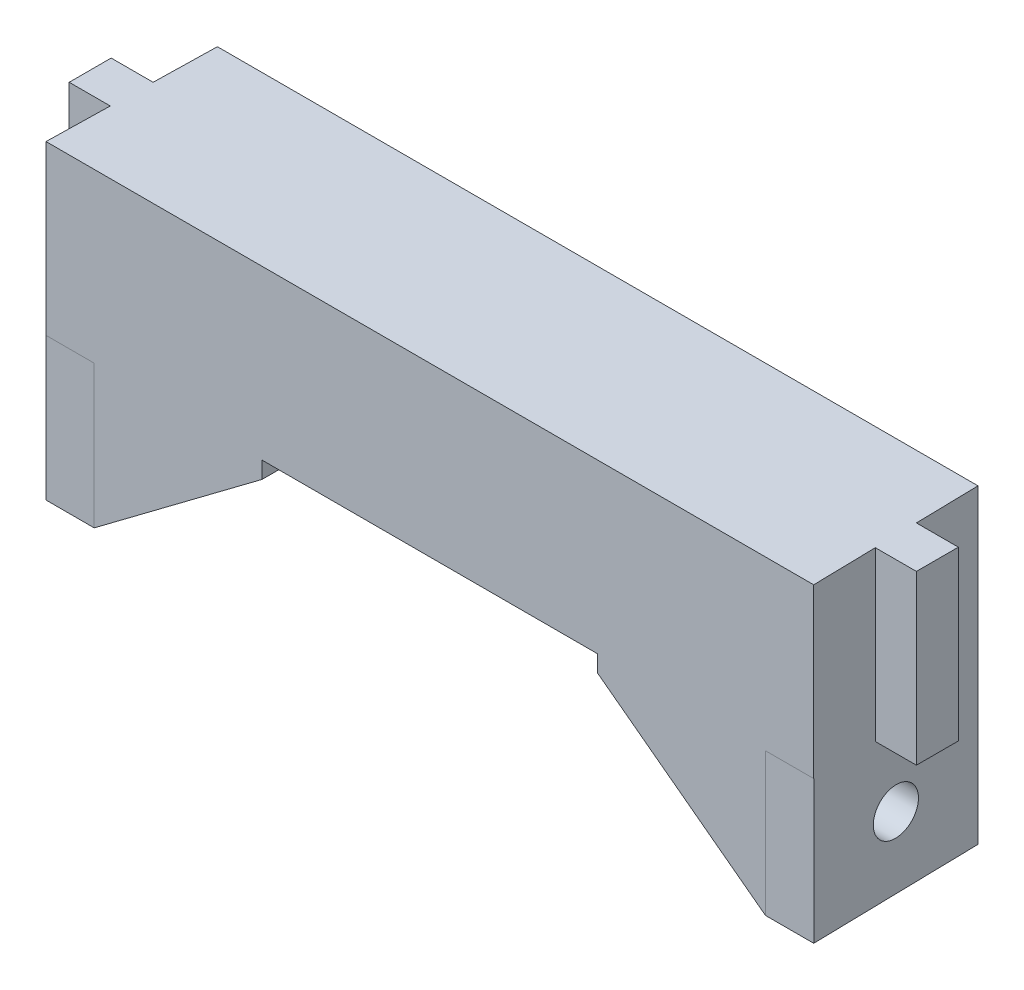
ISO-10303-21;
HEADER;
FILE_DESCRIPTION(('STEP AP214'),'2;1');
FILE_NAME('part.step','',(''),(''),'','','');
FILE_SCHEMA(('AUTOMOTIVE_DESIGN { 1 0 10303 214 1 1 1 1 }'));
ENDSEC;
DATA;
#1=APPLICATION_CONTEXT('core data for automotive mechanical design processes');
#2=APPLICATION_PROTOCOL_DEFINITION('international standard','automotive_design',2000,#1);
#3=PRODUCT_CONTEXT('',#1,'mechanical');
#4=PRODUCT('Part','Part','',(#3));
#5=PRODUCT_RELATED_PRODUCT_CATEGORY('part','',(#4));
#6=PRODUCT_DEFINITION_FORMATION('','',#4);
#7=PRODUCT_DEFINITION_CONTEXT('part definition',#1,'design');
#8=PRODUCT_DEFINITION('design','',#6,#7);
#9=PRODUCT_DEFINITION_SHAPE('','',#8);
#10=(LENGTH_UNIT() NAMED_UNIT(*) SI_UNIT(.MILLI.,.METRE.));
#11=(NAMED_UNIT(*) PLANE_ANGLE_UNIT() SI_UNIT($,.RADIAN.));
#12=(NAMED_UNIT(*) SI_UNIT($,.STERADIAN.) SOLID_ANGLE_UNIT());
#13=UNCERTAINTY_MEASURE_WITH_UNIT(LENGTH_MEASURE(1.E-05),#10,'distance_accuracy_value','');
#14=(GEOMETRIC_REPRESENTATION_CONTEXT(3) GLOBAL_UNCERTAINTY_ASSIGNED_CONTEXT((#13)) GLOBAL_UNIT_ASSIGNED_CONTEXT((#10,
#11,#12)) REPRESENTATION_CONTEXT('',''));
#15=CARTESIAN_POINT('',(0.,0.,0.));
#16=DIRECTION('',(0.,0.,1.));
#17=DIRECTION('',(1.,0.,0.));
#18=AXIS2_PLACEMENT_3D('',#15,#16,#17);
#19=CARTESIAN_POINT('',(0.,0.,0.));
#20=DIRECTION('',(0.,-1.,0.));
#21=DIRECTION('',(0.,0.,-1.));
#22=AXIS2_PLACEMENT_3D('',#19,#20,#21);
#23=PLANE('',#22);
#24=DIRECTION('',(-1.,0.,0.));
#25=VECTOR('',#24,1.);
#26=CARTESIAN_POINT('',(-45.3158214077717,0.,-20.));
#27=LINE('',#26,#25);
#28=CARTESIAN_POINT('',(20.,0.,-20.));
#29=VERTEX_POINT('',#28);
#30=CARTESIAN_POINT('',(-20.,0.,-20.));
#31=VERTEX_POINT('',#30);
#32=EDGE_CURVE('E441',#29,#31,#27,.T.);
#33=ORIENTED_EDGE('',*,*,#32,.F.);
#34=DIRECTION('',(0.,0.,-1.));
#35=VECTOR('',#34,1.);
#36=CARTESIAN_POINT('',(20.,0.,0.));
#37=LINE('',#36,#35);
#38=CARTESIAN_POINT('',(20.,0.,0.));
#39=VERTEX_POINT('',#38);
#40=EDGE_CURVE('E163',#29,#39,#37,.F.);
#41=ORIENTED_EDGE('',*,*,#40,.T.);
#42=DIRECTION('',(1.,0.,0.));
#43=VECTOR('',#42,1.);
#44=CARTESIAN_POINT('',(45.74,0.,0.));
#45=LINE('',#44,#43);
#46=CARTESIAN_POINT('',(-20.,0.,0.));
#47=VERTEX_POINT('',#46);
#48=EDGE_CURVE('E308',#47,#39,#45,.T.);
#49=ORIENTED_EDGE('',*,*,#48,.F.);
#50=DIRECTION('',(0.,0.,1.));
#51=VECTOR('',#50,1.);
#52=CARTESIAN_POINT('',(-20.,0.,-20.));
#53=LINE('',#52,#51);
#54=EDGE_CURVE('E575',#31,#47,#53,.T.);
#55=ORIENTED_EDGE('',*,*,#54,.F.);
#56=EDGE_LOOP('',(#33,#41,#49,#55));
#57=FACE_BOUND('',#56,.T.);
#58=ADVANCED_FACE('F139',(#57),#23,.T.);
#59=DIRECTION('',(0.0212041611335454,0.,0.99977516650026));
#60=VECTOR('',#59,1.);
#61=CARTESIAN_POINT('',(45.7194345436055,0.,-0.969660269109053));
#62=LINE('',#61,#60);
#63=CARTESIAN_POINT('',(45.4748883798573,0.,-12.5));
#64=VERTEX_POINT('',#63);
#65=CARTESIAN_POINT('',(45.5809330279144,0.,-7.49999999999999));
#66=VERTEX_POINT('',#65);
#67=EDGE_CURVE('E514',#64,#66,#62,.T.);
#68=ORIENTED_EDGE('',*,*,#67,.F.);
#69=DIRECTION('',(-1.,0.,0.));
#70=VECTOR('',#69,1.);
#71=CARTESIAN_POINT('',(45.4748883798573,0.,-12.5));
#72=LINE('',#71,#70);
#73=CARTESIAN_POINT('',(50.4748883798573,0.,-12.5));
#74=VERTEX_POINT('',#73);
#75=EDGE_CURVE('E483',#74,#64,#72,.T.);
#76=ORIENTED_EDGE('',*,*,#75,.F.);
#77=DIRECTION('',(0.,0.,-1.));
#78=VECTOR('',#77,1.);
#79=CARTESIAN_POINT('',(50.4748883798573,0.,-12.5));
#80=LINE('',#79,#78);
#81=CARTESIAN_POINT('',(50.4748883798573,0.,-7.49999999999999));
#82=VERTEX_POINT('',#81);
#83=EDGE_CURVE('E946',#82,#74,#80,.T.);
#84=ORIENTED_EDGE('',*,*,#83,.F.);
#85=DIRECTION('',(1.,0.,0.));
#86=VECTOR('',#85,1.);
#87=CARTESIAN_POINT('',(45.4748883798573,0.,-7.49999999999999));
#88=LINE('',#87,#86);
#89=EDGE_CURVE('E500',#66,#82,#88,.T.);
#90=ORIENTED_EDGE('',*,*,#89,.F.);
#91=EDGE_LOOP('',(#68,#76,#84,#90));
#92=FACE_BOUND('',#91,.T.);
#93=ADVANCED_FACE('F1083',(#92),#23,.T.);
#94=DIRECTION('',(0.999999628813922,0.,-0.000861610130870295));
#95=VECTOR('',#94,1.);
#96=CARTESIAN_POINT('',(40.,0.,0.));
#97=LINE('',#96,#95);
#98=CARTESIAN_POINT('',(40.,0.,0.));
#99=VERTEX_POINT('',#98);
#100=CARTESIAN_POINT('',(45.7398951101015,0.,-0.00494555361270745));
#101=VERTEX_POINT('',#100);
#102=EDGE_CURVE('E300',#99,#101,#97,.T.);
#103=ORIENTED_EDGE('',*,*,#102,.T.);
#104=DIRECTION('',(-0.0212041611335454,0.,-0.99977516650026));
#105=VECTOR('',#104,1.);
#106=CARTESIAN_POINT('',(45.3158214077717,0.,-20.));
#107=LINE('',#106,#105);
#108=CARTESIAN_POINT('',(45.74,0.,0.));
#109=VERTEX_POINT('',#108);
#110=EDGE_CURVE('E302',#109,#101,#107,.T.);
#111=ORIENTED_EDGE('',*,*,#110,.F.);
#112=EDGE_CURVE('E297',#99,#109,#45,.T.);
#113=ORIENTED_EDGE('',*,*,#112,.F.);
#114=EDGE_LOOP('',(#103,#111,#113));
#115=FACE_BOUND('',#114,.T.);
#116=ADVANCED_FACE('F299',(#115),#23,.T.);
#117=DIRECTION('',(-1.,0.,0.));
#118=VECTOR('',#117,1.);
#119=CARTESIAN_POINT('',(-45.4748883798573,0.,-12.5));
#120=LINE('',#119,#118);
#121=CARTESIAN_POINT('',(-45.4748883798573,0.,-12.5));
#122=VERTEX_POINT('',#121);
#123=CARTESIAN_POINT('',(-50.4748883798573,0.,-12.5));
#124=VERTEX_POINT('',#123);
#125=EDGE_CURVE('E466',#122,#124,#120,.T.);
#126=ORIENTED_EDGE('',*,*,#125,.F.);
#127=DIRECTION('',(-0.0212041611335457,0.,0.99977516650026));
#128=VECTOR('',#127,1.);
#129=CARTESIAN_POINT('',(-45.4748883798573,0.,-12.5));
#130=LINE('',#129,#128);
#131=CARTESIAN_POINT('',(-45.5809330279144,0.,-7.49999999999998));
#132=VERTEX_POINT('',#131);
#133=EDGE_CURVE('E14',#122,#132,#130,.T.);
#134=ORIENTED_EDGE('',*,*,#133,.T.);
#135=DIRECTION('',(1.,0.,0.));
#136=VECTOR('',#135,1.);
#137=CARTESIAN_POINT('',(-45.4748883798573,0.,-7.49999999999999));
#138=LINE('',#137,#136);
#139=CARTESIAN_POINT('',(-50.4748883798573,0.,-7.49999999999999));
#140=VERTEX_POINT('',#139);
#141=EDGE_CURVE('E873',#140,#132,#138,.T.);
#142=ORIENTED_EDGE('',*,*,#141,.F.);
#143=DIRECTION('',(0.,0.,1.));
#144=VECTOR('',#143,1.);
#145=CARTESIAN_POINT('',(-50.4748883798573,0.,-12.5));
#146=LINE('',#145,#144);
#147=EDGE_CURVE('E884',#124,#140,#146,.T.);
#148=ORIENTED_EDGE('',*,*,#147,.F.);
#149=EDGE_LOOP('',(#126,#134,#142,#148));
#150=FACE_BOUND('',#149,.T.);
#151=ADVANCED_FACE('F1079',(#150),#23,.T.);
#152=CARTESIAN_POINT('',(45.74,20.,0.));
#153=DIRECTION('',(0.,0.,-1.));
#154=DIRECTION('',(-1.,0.,0.));
#155=AXIS2_PLACEMENT_3D('',#152,#153,#154);
#156=PLANE('',#155);
#157=CARTESIAN_POINT('',(-45.74,0.,0.));
#158=VERTEX_POINT('',#157);
#159=CARTESIAN_POINT('',(-40.,0.,0.));
#160=VERTEX_POINT('',#159);
#161=EDGE_CURVE('E463',#158,#160,#45,.T.);
#162=ORIENTED_EDGE('',*,*,#161,.T.);
#163=DIRECTION('',(0.,1.,0.));
#164=VECTOR('',#163,1.);
#165=CARTESIAN_POINT('',(-40.,-17.,0.));
#166=LINE('',#165,#164);
#167=CARTESIAN_POINT('',(-40.,-17.,0.));
#168=VERTEX_POINT('',#167);
#169=EDGE_CURVE('E574',#168,#160,#166,.T.);
#170=ORIENTED_EDGE('',*,*,#169,.F.);
#171=DIRECTION('',(0.8,0.6,0.));
#172=VECTOR('',#171,1.);
#173=CARTESIAN_POINT('',(-40.,-17.,0.));
#174=LINE('',#173,#172);
#175=CARTESIAN_POINT('',(-20.,-2.,0.));
#176=VERTEX_POINT('',#175);
#177=EDGE_CURVE('E587',#168,#176,#174,.T.);
#178=ORIENTED_EDGE('',*,*,#177,.T.);
#179=DIRECTION('',(0.,-1.,0.));
#180=VECTOR('',#179,1.);
#181=CARTESIAN_POINT('',(-20.,0.,0.));
#182=LINE('',#181,#180);
#183=EDGE_CURVE('E561',#47,#176,#182,.T.);
#184=ORIENTED_EDGE('',*,*,#183,.F.);
#185=ORIENTED_EDGE('',*,*,#48,.T.);
#186=CARTESIAN_POINT('',(20.,0.,0.));
#187=DIRECTION('',(0.,-1.,0.));
#188=VECTOR('',#187,1.);
#189=LINE('',#186,#188);
#190=CARTESIAN_POINT('',(20.,-2.,0.));
#191=VERTEX_POINT('',#190);
#192=EDGE_CURVE('E348',#39,#191,#189,.T.);
#193=ORIENTED_EDGE('',*,*,#192,.T.);
#194=DIRECTION('',(-0.8,0.6,0.));
#195=VECTOR('',#194,1.);
#196=CARTESIAN_POINT('',(40.,-17.,0.));
#197=LINE('',#196,#195);
#198=CARTESIAN_POINT('',(40.,-17.,0.));
#199=VERTEX_POINT('',#198);
#200=EDGE_CURVE('E327',#199,#191,#197,.T.);
#201=ORIENTED_EDGE('',*,*,#200,.F.);
#202=CARTESIAN_POINT('',(40.,-17.,0.));
#203=DIRECTION('',(0.,1.,0.));
#204=VECTOR('',#203,1.);
#205=LINE('',#202,#204);
#206=EDGE_CURVE('E314',#199,#99,#205,.T.);
#207=ORIENTED_EDGE('',*,*,#206,.T.);
#208=ORIENTED_EDGE('',*,*,#112,.T.);
#209=DIRECTION('',(0.,-1.,0.));
#210=VECTOR('',#209,1.);
#211=CARTESIAN_POINT('',(45.74,20.,0.));
#212=LINE('',#211,#210);
#213=CARTESIAN_POINT('',(45.74,20.,0.));
#214=VERTEX_POINT('',#213);
#215=EDGE_CURVE('E150',#214,#109,#212,.T.);
#216=ORIENTED_EDGE('',*,*,#215,.F.);
#217=DIRECTION('',(1.,0.,0.));
#218=VECTOR('',#217,1.);
#219=CARTESIAN_POINT('',(45.74,20.,0.));
#220=LINE('',#219,#218);
#221=CARTESIAN_POINT('',(-45.74,20.,0.));
#222=VERTEX_POINT('',#221);
#223=EDGE_CURVE('E462',#222,#214,#220,.T.);
#224=ORIENTED_EDGE('',*,*,#223,.F.);
#225=DIRECTION('',(0.,-1.,0.));
#226=VECTOR('',#225,1.);
#227=CARTESIAN_POINT('',(-45.74,20.,0.));
#228=LINE('',#227,#226);
#229=EDGE_CURVE('E457',#222,#158,#228,.T.);
#230=ORIENTED_EDGE('',*,*,#229,.T.);
#231=EDGE_LOOP('',(#162,#170,#178,#184,#185,#193,#201,#207,#208,#216,#224,#230));
#232=FACE_BOUND('',#231,.T.);
#233=ADVANCED_FACE('F141',(#232),#156,.F.);
#234=CARTESIAN_POINT('',(45.3158214077717,20.,-20.));
#235=DIRECTION('',(-0.99977516650026,0.,0.0212041611335454));
#236=DIRECTION('',(0.0212041611335454,0.,0.99977516650026));
#237=AXIS2_PLACEMENT_3D('',#234,#235,#236);
#238=PLANE('',#237);
#239=CARTESIAN_POINT('',(45.5279107038858,-8.5,-10.));
#240=DIRECTION('',(-0.99977516650026,0.,0.0212041611335454));
#241=DIRECTION('',(-0.0212041611335454,0.,-0.99977516650026));
#242=AXIS2_PLACEMENT_3D('',#239,#240,#241);
#243=ELLIPSE('',#242,2.75061843116833,2.75);
#244=CARTESIAN_POINT('',(45.4695861474545,-8.5,-12.75));
#245=VERTEX_POINT('',#244);
#246=EDGE_CURVE('E353',#245,#245,#243,.F.);
#247=ORIENTED_EDGE('',*,*,#246,.F.);
#248=EDGE_LOOP('',(#247));
#249=FACE_BOUND('',#248,.T.);
#250=DIRECTION('',(-0.0212041611335454,0.,-0.99977516650026));
#251=VECTOR('',#250,1.);
#252=CARTESIAN_POINT('',(45.3158214077717,20.,-20.));
#253=LINE('',#252,#251);
#254=CARTESIAN_POINT('',(45.4748883798573,20.,-12.5));
#255=VERTEX_POINT('',#254);
#256=CARTESIAN_POINT('',(45.3158214077717,20.,-20.));
#257=VERTEX_POINT('',#256);
#258=EDGE_CURVE('E980',#255,#257,#253,.T.);
#259=ORIENTED_EDGE('',*,*,#258,.F.);
#260=DIRECTION('',(0.,1.,0.));
#261=VECTOR('',#260,1.);
#262=CARTESIAN_POINT('',(45.4748883798573,-7.07106781186547,-12.5));
#263=LINE('',#262,#261);
#264=EDGE_CURVE('E487',#64,#255,#263,.T.);
#265=ORIENTED_EDGE('',*,*,#264,.F.);
#266=ORIENTED_EDGE('',*,*,#67,.T.);
#267=DIRECTION('',(0.,1.,0.));
#268=VECTOR('',#267,1.);
#269=CARTESIAN_POINT('',(45.5809330279144,20.,-7.49999999999999));
#270=LINE('',#269,#268);
#271=CARTESIAN_POINT('',(45.5809330279144,20.,-7.49999999999999));
#272=VERTEX_POINT('',#271);
#273=EDGE_CURVE('E309',#66,#272,#270,.T.);
#274=ORIENTED_EDGE('',*,*,#273,.T.);
#275=EDGE_CURVE('E985',#214,#272,#253,.T.);
#276=ORIENTED_EDGE('',*,*,#275,.F.);
#277=ORIENTED_EDGE('',*,*,#215,.T.);
#278=ORIENTED_EDGE('',*,*,#110,.T.);
#279=CARTESIAN_POINT('',(45.7398951101015,0.,-0.00494555361270355));
#280=DIRECTION('',(0.,-1.,0.));
#281=VECTOR('',#280,1.);
#282=LINE('',#279,#281);
#283=CARTESIAN_POINT('',(45.7398951101015,-17.,-0.00494555361270355));
#284=VERTEX_POINT('',#283);
#285=EDGE_CURVE('E318',#101,#284,#282,.T.);
#286=ORIENTED_EDGE('',*,*,#285,.T.);
#287=CARTESIAN_POINT('',(45.3158214077717,-17.,-20.));
#288=DIRECTION('',(0.0212041611335454,0.,0.99977516650026));
#289=VECTOR('',#288,1.);
#290=LINE('',#287,#289);
#291=CARTESIAN_POINT('',(45.3158214077717,-17.,-20.));
#292=VERTEX_POINT('',#291);
#293=EDGE_CURVE('E719',#292,#284,#290,.T.);
#294=ORIENTED_EDGE('',*,*,#293,.F.);
#295=CARTESIAN_POINT('',(45.3158214077717,0.,-20.));
#296=DIRECTION('',(0.,-1.,0.));
#297=VECTOR('',#296,1.);
#298=LINE('',#295,#297);
#299=CARTESIAN_POINT('',(45.3158214077717,0.,-20.));
#300=VERTEX_POINT('',#299);
#301=EDGE_CURVE('E321',#300,#292,#298,.T.);
#302=ORIENTED_EDGE('',*,*,#301,.F.);
#303=DIRECTION('',(0.,-1.,0.));
#304=VECTOR('',#303,1.);
#305=CARTESIAN_POINT('',(45.3158214077717,20.,-20.));
#306=LINE('',#305,#304);
#307=EDGE_CURVE('E507',#257,#300,#306,.T.);
#308=ORIENTED_EDGE('',*,*,#307,.F.);
#309=EDGE_LOOP('',(#259,#265,#266,#274,#276,#277,#278,#286,#294,#302,#308));
#310=FACE_BOUND('',#309,.T.);
#311=ADVANCED_FACE('F536',(#249,#310),#238,.F.);
#312=CARTESIAN_POINT('',(-45.3158214077717,20.,-20.));
#313=DIRECTION('',(0.,0.,1.));
#314=DIRECTION('',(1.,0.,0.));
#315=AXIS2_PLACEMENT_3D('',#312,#313,#314);
#316=PLANE('',#315);
#317=CARTESIAN_POINT('',(20.,-2.,-20.));
#318=DIRECTION('',(0.,1.,0.));
#319=VECTOR('',#318,1.);
#320=LINE('',#317,#319);
#321=CARTESIAN_POINT('',(20.,-2.,-20.));
#322=VERTEX_POINT('',#321);
#323=EDGE_CURVE('E414',#322,#29,#320,.T.);
#324=ORIENTED_EDGE('',*,*,#323,.T.);
#325=ORIENTED_EDGE('',*,*,#32,.T.);
#326=DIRECTION('',(0.,1.,0.));
#327=VECTOR('',#326,1.);
#328=CARTESIAN_POINT('',(-20.,0.,-20.));
#329=LINE('',#328,#327);
#330=CARTESIAN_POINT('',(-20.,-2.,-20.));
#331=VERTEX_POINT('',#330);
#332=EDGE_CURVE('E655',#331,#31,#329,.T.);
#333=ORIENTED_EDGE('',*,*,#332,.F.);
#334=DIRECTION('',(0.8,0.6,0.));
#335=VECTOR('',#334,1.);
#336=CARTESIAN_POINT('',(-40.,-17.,-20.));
#337=LINE('',#336,#335);
#338=CARTESIAN_POINT('',(-40.,-17.,-20.));
#339=VERTEX_POINT('',#338);
#340=EDGE_CURVE('E651',#339,#331,#337,.T.);
#341=ORIENTED_EDGE('',*,*,#340,.F.);
#342=DIRECTION('',(-1.,0.,0.));
#343=VECTOR('',#342,1.);
#344=CARTESIAN_POINT('',(-40.,-17.,-20.));
#345=LINE('',#344,#343);
#346=CARTESIAN_POINT('',(-45.3158214077717,-17.,-20.));
#347=VERTEX_POINT('',#346);
#348=EDGE_CURVE('E580',#339,#347,#345,.T.);
#349=ORIENTED_EDGE('',*,*,#348,.T.);
#350=DIRECTION('',(0.,-1.,0.));
#351=VECTOR('',#350,1.);
#352=CARTESIAN_POINT('',(-45.3158214077717,0.,-20.));
#353=LINE('',#352,#351);
#354=CARTESIAN_POINT('',(-45.3158214077717,0.,-20.));
#355=VERTEX_POINT('',#354);
#356=EDGE_CURVE('E798',#355,#347,#353,.T.);
#357=ORIENTED_EDGE('',*,*,#356,.F.);
#358=DIRECTION('',(0.,-1.,0.));
#359=VECTOR('',#358,1.);
#360=CARTESIAN_POINT('',(-45.3158214077717,20.,-20.));
#361=LINE('',#360,#359);
#362=CARTESIAN_POINT('',(-45.3158214077717,20.,-20.));
#363=VERTEX_POINT('',#362);
#364=EDGE_CURVE('E511',#363,#355,#361,.T.);
#365=ORIENTED_EDGE('',*,*,#364,.F.);
#366=DIRECTION('',(-1.,0.,0.));
#367=VECTOR('',#366,1.);
#368=CARTESIAN_POINT('',(-45.3158214077717,20.,-20.));
#369=LINE('',#368,#367);
#370=EDGE_CURVE('E991',#257,#363,#369,.T.);
#371=ORIENTED_EDGE('',*,*,#370,.F.);
#372=ORIENTED_EDGE('',*,*,#307,.T.);
#373=ORIENTED_EDGE('',*,*,#301,.T.);
#374=DIRECTION('',(1.,0.,0.));
#375=VECTOR('',#374,1.);
#376=CARTESIAN_POINT('',(40.,-17.,-20.));
#377=LINE('',#376,#375);
#378=CARTESIAN_POINT('',(40.,-17.,-20.));
#379=VERTEX_POINT('',#378);
#380=EDGE_CURVE('E330',#379,#292,#377,.T.);
#381=ORIENTED_EDGE('',*,*,#380,.F.);
#382=DIRECTION('',(-0.8,0.6,0.));
#383=VECTOR('',#382,1.);
#384=CARTESIAN_POINT('',(40.,-17.,-20.));
#385=LINE('',#384,#383);
#386=EDGE_CURVE('E410',#379,#322,#385,.T.);
#387=ORIENTED_EDGE('',*,*,#386,.T.);
#388=EDGE_LOOP('',(#324,#325,#333,#341,#349,#357,#365,#371,#372,#373,#381,#387));
#389=FACE_BOUND('',#388,.T.);
#390=ADVANCED_FACE('F526',(#389),#316,.F.);
#391=CARTESIAN_POINT('',(-45.74,20.,0.));
#392=DIRECTION('',(0.99977516650026,0.,0.0212041611335453));
#393=DIRECTION('',(0.0212041611335453,0.,-0.99977516650026));
#394=AXIS2_PLACEMENT_3D('',#391,#392,#393);
#395=PLANE('',#394);
#396=CARTESIAN_POINT('',(-45.5279107038858,-8.5,-10.));
#397=DIRECTION('',(0.99977516650026,0.,0.0212041611335453));
#398=DIRECTION('',(0.0212041611335453,0.,-0.99977516650026));
#399=AXIS2_PLACEMENT_3D('',#396,#397,#398);
#400=ELLIPSE('',#399,2.75061843116833,2.75);
#401=CARTESIAN_POINT('',(-45.4695861474545,-8.5,-12.75));
#402=VERTEX_POINT('',#401);
#403=EDGE_CURVE('E583',#402,#402,#400,.T.);
#404=ORIENTED_EDGE('',*,*,#403,.T.);
#405=EDGE_LOOP('',(#404));
#406=FACE_BOUND('',#405,.T.);
#407=ORIENTED_EDGE('',*,*,#364,.T.);
#408=ORIENTED_EDGE('',*,*,#356,.T.);
#409=DIRECTION('',(-0.0212041611335454,0.,0.99977516650026));
#410=VECTOR('',#409,1.);
#411=CARTESIAN_POINT('',(-45.3158214077717,-17.,-20.));
#412=LINE('',#411,#410);
#413=CARTESIAN_POINT('',(-45.7398951101015,-17.,-0.00494555361270355));
#414=VERTEX_POINT('',#413);
#415=EDGE_CURVE('E792',#347,#414,#412,.T.);
#416=ORIENTED_EDGE('',*,*,#415,.T.);
#417=DIRECTION('',(0.,-1.,0.));
#418=VECTOR('',#417,1.);
#419=CARTESIAN_POINT('',(-45.7398951101015,0.,-0.00494555361270745));
#420=LINE('',#419,#418);
#421=CARTESIAN_POINT('',(-45.7398951101015,0.,-0.00494555361270745));
#422=VERTEX_POINT('',#421);
#423=EDGE_CURVE('E788',#422,#414,#420,.T.);
#424=ORIENTED_EDGE('',*,*,#423,.F.);
#425=DIRECTION('',(-0.0212041611335453,0.,0.99977516650026));
#426=VECTOR('',#425,1.);
#427=CARTESIAN_POINT('',(-45.74,0.,0.));
#428=LINE('',#427,#426);
#429=EDGE_CURVE('E446',#422,#158,#428,.T.);
#430=ORIENTED_EDGE('',*,*,#429,.T.);
#431=ORIENTED_EDGE('',*,*,#229,.F.);
#432=DIRECTION('',(-0.0212041611335453,0.,0.99977516650026));
#433=VECTOR('',#432,1.);
#434=CARTESIAN_POINT('',(-45.74,20.,0.));
#435=LINE('',#434,#433);
#436=CARTESIAN_POINT('',(-45.5809330279144,20.,-7.49999999999999));
#437=VERTEX_POINT('',#436);
#438=EDGE_CURVE('E995',#437,#222,#435,.T.);
#439=ORIENTED_EDGE('',*,*,#438,.F.);
#440=DIRECTION('',(0.,-1.,0.));
#441=VECTOR('',#440,1.);
#442=CARTESIAN_POINT('',(-45.5809330279144,20.,-7.49999999999999));
#443=LINE('',#442,#441);
#444=EDGE_CURVE('E917',#437,#132,#443,.T.);
#445=ORIENTED_EDGE('',*,*,#444,.T.);
#446=ORIENTED_EDGE('',*,*,#133,.F.);
#447=DIRECTION('',(0.,1.,0.));
#448=VECTOR('',#447,1.);
#449=CARTESIAN_POINT('',(-45.4748883798573,-7.07106781186547,-12.5));
#450=LINE('',#449,#448);
#451=CARTESIAN_POINT('',(-45.4748883798573,20.,-12.4999999999999));
#452=VERTEX_POINT('',#451);
#453=EDGE_CURVE('E791',#122,#452,#450,.T.);
#454=ORIENTED_EDGE('',*,*,#453,.T.);
#455=EDGE_CURVE('E470',#363,#452,#435,.T.);
#456=ORIENTED_EDGE('',*,*,#455,.F.);
#457=EDGE_LOOP('',(#407,#408,#416,#424,#430,#431,#439,#445,#446,#454,#456));
#458=FACE_BOUND('',#457,.T.);
#459=ADVANCED_FACE('F535',(#406,#458),#395,.F.);
#460=CARTESIAN_POINT('',(0.,20.,0.));
#461=DIRECTION('',(0.,-1.,0.));
#462=DIRECTION('',(0.,0.,-1.));
#463=AXIS2_PLACEMENT_3D('',#460,#461,#462);
#464=PLANE('',#463);
#465=ORIENTED_EDGE('',*,*,#455,.T.);
#466=DIRECTION('',(-1.,0.,0.));
#467=VECTOR('',#466,1.);
#468=CARTESIAN_POINT('',(-45.4748883798573,20.,-12.5));
#469=LINE('',#468,#467);
#470=CARTESIAN_POINT('',(-50.4748883798573,20.,-12.5));
#471=VERTEX_POINT('',#470);
#472=EDGE_CURVE('E911',#452,#471,#469,.T.);
#473=ORIENTED_EDGE('',*,*,#472,.T.);
#474=DIRECTION('',(0.,0.,1.));
#475=VECTOR('',#474,1.);
#476=CARTESIAN_POINT('',(-50.4748883798573,20.,-12.5));
#477=LINE('',#476,#475);
#478=CARTESIAN_POINT('',(-50.4748883798573,20.,-7.49999999999999));
#479=VERTEX_POINT('',#478);
#480=EDGE_CURVE('E905',#471,#479,#477,.T.);
#481=ORIENTED_EDGE('',*,*,#480,.T.);
#482=DIRECTION('',(1.,0.,0.));
#483=VECTOR('',#482,1.);
#484=CARTESIAN_POINT('',(-45.4748883798573,20.,-7.49999999999999));
#485=LINE('',#484,#483);
#486=EDGE_CURVE('E900',#479,#437,#485,.T.);
#487=ORIENTED_EDGE('',*,*,#486,.T.);
#488=ORIENTED_EDGE('',*,*,#438,.T.);
#489=ORIENTED_EDGE('',*,*,#223,.T.);
#490=ORIENTED_EDGE('',*,*,#275,.T.);
#491=DIRECTION('',(1.,0.,0.));
#492=VECTOR('',#491,1.);
#493=CARTESIAN_POINT('',(45.4748883798573,20.,-7.49999999999999));
#494=LINE('',#493,#492);
#495=CARTESIAN_POINT('',(50.4748883798573,20.,-7.49999999999999));
#496=VERTEX_POINT('',#495);
#497=EDGE_CURVE('E923',#272,#496,#494,.T.);
#498=ORIENTED_EDGE('',*,*,#497,.T.);
#499=DIRECTION('',(0.,0.,-1.));
#500=VECTOR('',#499,1.);
#501=CARTESIAN_POINT('',(50.4748883798573,20.,-12.5));
#502=LINE('',#501,#500);
#503=CARTESIAN_POINT('',(50.4748883798573,20.,-12.5));
#504=VERTEX_POINT('',#503);
#505=EDGE_CURVE('E928',#496,#504,#502,.T.);
#506=ORIENTED_EDGE('',*,*,#505,.T.);
#507=DIRECTION('',(-1.,0.,0.));
#508=VECTOR('',#507,1.);
#509=CARTESIAN_POINT('',(45.4748883798573,20.,-12.5));
#510=LINE('',#509,#508);
#511=EDGE_CURVE('E504',#504,#255,#510,.T.);
#512=ORIENTED_EDGE('',*,*,#511,.T.);
#513=ORIENTED_EDGE('',*,*,#258,.T.);
#514=ORIENTED_EDGE('',*,*,#370,.T.);
#515=EDGE_LOOP('',(#465,#473,#481,#487,#488,#489,#490,#498,#506,#512,#513,#514));
#516=FACE_BOUND('',#515,.T.);
#517=ADVANCED_FACE('F1022',(#516),#464,.F.);
#518=DIRECTION('',(-0.999999628813922,0.,-0.000861610130870295));
#519=VECTOR('',#518,1.);
#520=CARTESIAN_POINT('',(-40.,0.,0.));
#521=LINE('',#520,#519);
#522=EDGE_CURVE('E804',#160,#422,#521,.T.);
#523=ORIENTED_EDGE('',*,*,#522,.F.);
#524=ORIENTED_EDGE('',*,*,#161,.F.);
#525=ORIENTED_EDGE('',*,*,#429,.F.);
#526=EDGE_LOOP('',(#523,#524,#525));
#527=FACE_BOUND('',#526,.T.);
#528=ADVANCED_FACE('F1031',(#527),#23,.T.);
#529=CARTESIAN_POINT('',(45.4748883798573,-7.07106781186547,-7.49999999999999));
#530=DIRECTION('',(0.,0.,1.));
#531=DIRECTION('',(1.,0.,0.));
#532=AXIS2_PLACEMENT_3D('',#529,#530,#531);
#533=PLANE('',#532);
#534=ORIENTED_EDGE('',*,*,#273,.F.);
#535=ORIENTED_EDGE('',*,*,#89,.T.);
#536=DIRECTION('',(0.,1.,0.));
#537=VECTOR('',#536,1.);
#538=CARTESIAN_POINT('',(50.4748883798573,-7.07106781186547,-7.49999999999999));
#539=LINE('',#538,#537);
#540=EDGE_CURVE('E503',#82,#496,#539,.T.);
#541=ORIENTED_EDGE('',*,*,#540,.T.);
#542=ORIENTED_EDGE('',*,*,#497,.F.);
#543=EDGE_LOOP('',(#534,#535,#541,#542));
#544=FACE_BOUND('',#543,.T.);
#545=ADVANCED_FACE('F1072',(#544),#533,.T.);
#546=CARTESIAN_POINT('',(50.4748883798573,-7.07106781186547,-12.5));
#547=DIRECTION('',(1.,0.,0.));
#548=DIRECTION('',(0.,0.,-1.));
#549=AXIS2_PLACEMENT_3D('',#546,#547,#548);
#550=PLANE('',#549);
#551=ORIENTED_EDGE('',*,*,#540,.F.);
#552=ORIENTED_EDGE('',*,*,#83,.T.);
#553=DIRECTION('',(0.,1.,0.));
#554=VECTOR('',#553,1.);
#555=CARTESIAN_POINT('',(50.4748883798573,-7.07106781186547,-12.5));
#556=LINE('',#555,#554);
#557=EDGE_CURVE('E488',#74,#504,#556,.T.);
#558=ORIENTED_EDGE('',*,*,#557,.T.);
#559=ORIENTED_EDGE('',*,*,#505,.F.);
#560=EDGE_LOOP('',(#551,#552,#558,#559));
#561=FACE_BOUND('',#560,.T.);
#562=ADVANCED_FACE('F1068',(#561),#550,.T.);
#563=CARTESIAN_POINT('',(45.4748883798573,-7.07106781186547,-12.5));
#564=DIRECTION('',(0.,0.,-1.));
#565=DIRECTION('',(-1.,0.,0.));
#566=AXIS2_PLACEMENT_3D('',#563,#564,#565);
#567=PLANE('',#566);
#568=ORIENTED_EDGE('',*,*,#557,.F.);
#569=ORIENTED_EDGE('',*,*,#75,.T.);
#570=ORIENTED_EDGE('',*,*,#264,.T.);
#571=ORIENTED_EDGE('',*,*,#511,.F.);
#572=EDGE_LOOP('',(#568,#569,#570,#571));
#573=FACE_BOUND('',#572,.T.);
#574=ADVANCED_FACE('F1064',(#573),#567,.T.);
#575=CARTESIAN_POINT('',(-45.4748883798573,-7.07106781186547,-7.49999999999999));
#576=DIRECTION('',(0.,0.,1.));
#577=DIRECTION('',(1.,0.,0.));
#578=AXIS2_PLACEMENT_3D('',#575,#576,#577);
#579=PLANE('',#578);
#580=ORIENTED_EDGE('',*,*,#444,.F.);
#581=ORIENTED_EDGE('',*,*,#486,.F.);
#582=DIRECTION('',(0.,1.,0.));
#583=VECTOR('',#582,1.);
#584=CARTESIAN_POINT('',(-50.4748883798573,-7.07106781186547,-7.49999999999999));
#585=LINE('',#584,#583);
#586=EDGE_CURVE('E879',#140,#479,#585,.T.);
#587=ORIENTED_EDGE('',*,*,#586,.F.);
#588=ORIENTED_EDGE('',*,*,#141,.T.);
#589=EDGE_LOOP('',(#580,#581,#587,#588));
#590=FACE_BOUND('',#589,.T.);
#591=ADVANCED_FACE('F1057',(#590),#579,.T.);
#592=CARTESIAN_POINT('',(-45.4748883798573,-7.07106781186547,-12.5));
#593=DIRECTION('',(0.,0.,-1.));
#594=DIRECTION('',(-1.,0.,0.));
#595=AXIS2_PLACEMENT_3D('',#592,#593,#594);
#596=PLANE('',#595);
#597=ORIENTED_EDGE('',*,*,#453,.F.);
#598=ORIENTED_EDGE('',*,*,#125,.T.);
#599=DIRECTION('',(0.,1.,0.));
#600=VECTOR('',#599,1.);
#601=CARTESIAN_POINT('',(-50.4748883798573,-7.07106781186547,-12.5));
#602=LINE('',#601,#600);
#603=EDGE_CURVE('E890',#124,#471,#602,.T.);
#604=ORIENTED_EDGE('',*,*,#603,.T.);
#605=ORIENTED_EDGE('',*,*,#472,.F.);
#606=EDGE_LOOP('',(#597,#598,#604,#605));
#607=FACE_BOUND('',#606,.T.);
#608=ADVANCED_FACE('F1053',(#607),#596,.T.);
#609=CARTESIAN_POINT('',(-50.4748883798573,-7.07106781186547,-12.5));
#610=DIRECTION('',(-1.,0.,0.));
#611=DIRECTION('',(0.,0.,1.));
#612=AXIS2_PLACEMENT_3D('',#609,#610,#611);
#613=PLANE('',#612);
#614=ORIENTED_EDGE('',*,*,#603,.F.);
#615=ORIENTED_EDGE('',*,*,#147,.T.);
#616=ORIENTED_EDGE('',*,*,#586,.T.);
#617=ORIENTED_EDGE('',*,*,#480,.F.);
#618=EDGE_LOOP('',(#614,#615,#616,#617));
#619=FACE_BOUND('',#618,.T.);
#620=ADVANCED_FACE('F1056',(#619),#613,.T.);
#621=CARTESIAN_POINT('',(0.,-17.,0.));
#622=DIRECTION('',(0.,1.,0.));
#623=DIRECTION('',(0.,0.,1.));
#624=AXIS2_PLACEMENT_3D('',#621,#622,#623);
#625=PLANE('',#624);
#626=DIRECTION('',(-0.999999628813922,0.,-0.000861610130868633));
#627=VECTOR('',#626,1.);
#628=CARTESIAN_POINT('',(-40.,-17.,0.));
#629=LINE('',#628,#627);
#630=EDGE_CURVE('E853',#168,#414,#629,.T.);
#631=ORIENTED_EDGE('',*,*,#630,.T.);
#632=ORIENTED_EDGE('',*,*,#415,.F.);
#633=ORIENTED_EDGE('',*,*,#348,.F.);
#634=DIRECTION('',(0.,0.,1.));
#635=VECTOR('',#634,1.);
#636=CARTESIAN_POINT('',(-40.,-17.,-20.));
#637=LINE('',#636,#635);
#638=EDGE_CURVE('E565',#339,#168,#637,.T.);
#639=ORIENTED_EDGE('',*,*,#638,.T.);
#640=EDGE_LOOP('',(#631,#632,#633,#639));
#641=FACE_BOUND('',#640,.T.);
#642=ADVANCED_FACE('F618',(#641),#625,.F.);
#643=CARTESIAN_POINT('',(-2.96948807047413E-05,0.,0.034464392442114));
#644=DIRECTION('',(-0.000861610130870295,0.,0.999999628813922));
#645=DIRECTION('',(0.999999628813922,0.,0.000861610130870295));
#646=AXIS2_PLACEMENT_3D('',#643,#644,#645);
#647=PLANE('',#646);
#648=ORIENTED_EDGE('',*,*,#522,.T.);
#649=ORIENTED_EDGE('',*,*,#423,.T.);
#650=ORIENTED_EDGE('',*,*,#630,.F.);
#651=ORIENTED_EDGE('',*,*,#169,.T.);
#652=EDGE_LOOP('',(#648,#649,#650,#651));
#653=FACE_BOUND('',#652,.T.);
#654=ADVANCED_FACE('F615',(#653),#647,.T.);
#655=CARTESIAN_POINT('',(-20.,0.,0.));
#656=DIRECTION('',(-1.,0.,0.));
#657=DIRECTION('',(0.,0.,1.));
#658=AXIS2_PLACEMENT_3D('',#655,#656,#657);
#659=PLANE('',#658);
#660=ORIENTED_EDGE('',*,*,#332,.T.);
#661=ORIENTED_EDGE('',*,*,#54,.T.);
#662=ORIENTED_EDGE('',*,*,#183,.T.);
#663=DIRECTION('',(0.,0.,-1.));
#664=VECTOR('',#663,1.);
#665=CARTESIAN_POINT('',(-20.,-2.,-20.));
#666=LINE('',#665,#664);
#667=CARTESIAN_POINT('',(-20.,-2.,-9.99999999999999));
#668=VERTEX_POINT('',#667);
#669=EDGE_CURVE('E648',#176,#668,#666,.T.);
#670=ORIENTED_EDGE('',*,*,#669,.T.);
#671=DIRECTION('',(0.,0.,-1.));
#672=VECTOR('',#671,1.);
#673=CARTESIAN_POINT('',(-20.,-2.,-20.));
#674=LINE('',#673,#672);
#675=EDGE_CURVE('E594',#668,#331,#674,.T.);
#676=ORIENTED_EDGE('',*,*,#675,.T.);
#677=EDGE_LOOP('',(#660,#661,#662,#670,#676));
#678=FACE_BOUND('',#677,.T.);
#679=ADVANCED_FACE('F604',(#678),#659,.F.);
#680=CARTESIAN_POINT('',(-6.24,8.32,0.));
#681=DIRECTION('',(-0.6,0.8,0.));
#682=DIRECTION('',(-0.8,-0.6,0.));
#683=AXIS2_PLACEMENT_3D('',#680,#681,#682);
#684=PLANE('',#683);
#685=ORIENTED_EDGE('',*,*,#675,.F.);
#686=CARTESIAN_POINT('',(-28.6666666666667,-8.5,-10.));
#687=DIRECTION('',(-0.6,0.8,0.));
#688=DIRECTION('',(-0.8,-0.6,0.));
#689=AXIS2_PLACEMENT_3D('',#686,#687,#688);
#690=ELLIPSE('',#689,10.8333333333333,6.5);
#691=EDGE_CURVE('E663',#668,#668,#690,.F.);
#692=ORIENTED_EDGE('',*,*,#691,.F.);
#693=ORIENTED_EDGE('',*,*,#669,.F.);
#694=ORIENTED_EDGE('',*,*,#177,.F.);
#695=ORIENTED_EDGE('',*,*,#638,.F.);
#696=ORIENTED_EDGE('',*,*,#340,.T.);
#697=EDGE_LOOP('',(#685,#692,#693,#694,#695,#696));
#698=FACE_BOUND('',#697,.T.);
#699=ADVANCED_FACE('F614',(#698),#684,.F.);
#700=CARTESIAN_POINT('',(-50.4749133798573,-8.5,-10.));
#701=DIRECTION('',(1.,0.,0.));
#702=DIRECTION('',(0.,0.,-1.));
#703=AXIS2_PLACEMENT_3D('',#700,#701,#702);
#704=CYLINDRICAL_SURFACE('',#703,2.75);
#705=CARTESIAN_POINT('',(-40.,-8.5,-10.));
#706=DIRECTION('',(1.,0.,0.));
#707=DIRECTION('',(0.,0.,-1.));
#708=AXIS2_PLACEMENT_3D('',#705,#706,#707);
#709=CIRCLE('',#708,2.75);
#710=CARTESIAN_POINT('',(-40.,-8.5,-12.75));
#711=VERTEX_POINT('',#710);
#712=EDGE_CURVE('E588',#711,#711,#709,.T.);
#713=ORIENTED_EDGE('',*,*,#712,.T.);
#714=EDGE_LOOP('',(#713));
#715=FACE_BOUND('',#714,.T.);
#716=ORIENTED_EDGE('',*,*,#403,.F.);
#717=EDGE_LOOP('',(#716));
#718=FACE_BOUND('',#717,.T.);
#719=ADVANCED_FACE('F1138',(#715,#718),#704,.F.);
#720=CARTESIAN_POINT('',(-10.,-8.5,-10.));
#721=DIRECTION('',(-1.,0.,0.));
#722=DIRECTION('',(0.,0.,1.));
#723=AXIS2_PLACEMENT_3D('',#720,#721,#722);
#724=CYLINDRICAL_SURFACE('',#723,6.5);
#725=CARTESIAN_POINT('',(-40.,-8.5,-10.));
#726=DIRECTION('',(1.,0.,0.));
#727=DIRECTION('',(0.,0.,-1.));
#728=AXIS2_PLACEMENT_3D('',#725,#726,#727);
#729=CIRCLE('',#728,6.5);
#730=CARTESIAN_POINT('',(-40.,-8.5,-16.5));
#731=VERTEX_POINT('',#730);
#732=EDGE_CURVE('E517',#731,#731,#729,.T.);
#733=ORIENTED_EDGE('',*,*,#732,.F.);
#734=EDGE_LOOP('',(#733));
#735=FACE_BOUND('',#734,.T.);
#736=ORIENTED_EDGE('',*,*,#691,.T.);
#737=EDGE_LOOP('',(#736));
#738=FACE_BOUND('',#737,.T.);
#739=ADVANCED_FACE('F1136',(#735,#738),#724,.F.);
#740=CARTESIAN_POINT('',(-40.,-8.5,-10.));
#741=DIRECTION('',(1.,0.,0.));
#742=DIRECTION('',(0.,0.,-1.));
#743=AXIS2_PLACEMENT_3D('',#740,#741,#742);
#744=PLANE('',#743);
#745=ORIENTED_EDGE('',*,*,#712,.F.);
#746=EDGE_LOOP('',(#745));
#747=FACE_BOUND('',#746,.T.);
#748=ORIENTED_EDGE('',*,*,#732,.T.);
#749=EDGE_LOOP('',(#748));
#750=FACE_BOUND('',#749,.T.);
#751=ADVANCED_FACE('F683',(#747,#750),#744,.T.);
#752=CARTESIAN_POINT('',(0.,-17.,0.));
#753=DIRECTION('',(0.,1.,0.));
#754=DIRECTION('',(0.,0.,1.));
#755=AXIS2_PLACEMENT_3D('',#752,#753,#754);
#756=PLANE('',#755);
#757=DIRECTION('',(0.999999628813922,0.,-0.000861610130868633));
#758=VECTOR('',#757,1.);
#759=CARTESIAN_POINT('',(40.,-17.,0.));
#760=LINE('',#759,#758);
#761=EDGE_CURVE('E322',#199,#284,#760,.T.);
#762=ORIENTED_EDGE('',*,*,#761,.F.);
#763=CARTESIAN_POINT('',(40.,-17.,-20.));
#764=DIRECTION('',(0.,0.,1.));
#765=VECTOR('',#764,1.);
#766=LINE('',#763,#765);
#767=EDGE_CURVE('E331',#379,#199,#766,.T.);
#768=ORIENTED_EDGE('',*,*,#767,.F.);
#769=ORIENTED_EDGE('',*,*,#380,.T.);
#770=ORIENTED_EDGE('',*,*,#293,.T.);
#771=EDGE_LOOP('',(#762,#768,#769,#770));
#772=FACE_BOUND('',#771,.T.);
#773=ADVANCED_FACE('F681',(#772),#756,.F.);
#774=CARTESIAN_POINT('',(2.96948807047413E-05,0.,0.034464392442114));
#775=DIRECTION('',(0.000861610130870295,0.,0.999999628813922));
#776=DIRECTION('',(-0.999999628813922,0.,0.000861610130870295));
#777=AXIS2_PLACEMENT_3D('',#774,#775,#776);
#778=PLANE('',#777);
#779=ORIENTED_EDGE('',*,*,#102,.F.);
#780=ORIENTED_EDGE('',*,*,#206,.F.);
#781=ORIENTED_EDGE('',*,*,#761,.T.);
#782=ORIENTED_EDGE('',*,*,#285,.F.);
#783=EDGE_LOOP('',(#779,#780,#781,#782));
#784=FACE_BOUND('',#783,.T.);
#785=ADVANCED_FACE('F313',(#784),#778,.T.);
#786=CARTESIAN_POINT('',(20.,0.,0.));
#787=DIRECTION('',(1.,0.,0.));
#788=DIRECTION('',(0.,0.,1.));
#789=AXIS2_PLACEMENT_3D('',#786,#787,#788);
#790=PLANE('',#789);
#791=ORIENTED_EDGE('',*,*,#323,.F.);
#792=CARTESIAN_POINT('',(20.,-2.,-9.99999999999999));
#793=DIRECTION('',(0.,0.,-1.));
#794=VECTOR('',#793,1.);
#795=LINE('',#792,#794);
#796=CARTESIAN_POINT('',(20.,-2.,-9.99999999999999));
#797=VERTEX_POINT('',#796);
#798=EDGE_CURVE('E368',#797,#322,#795,.T.);
#799=ORIENTED_EDGE('',*,*,#798,.F.);
#800=CARTESIAN_POINT('',(20.,-2.,0.));
#801=DIRECTION('',(0.,0.,-1.));
#802=VECTOR('',#801,1.);
#803=LINE('',#800,#802);
#804=EDGE_CURVE('E425',#191,#797,#803,.T.);
#805=ORIENTED_EDGE('',*,*,#804,.F.);
#806=ORIENTED_EDGE('',*,*,#192,.F.);
#807=ORIENTED_EDGE('',*,*,#40,.F.);
#808=EDGE_LOOP('',(#791,#799,#805,#806,#807));
#809=FACE_BOUND('',#808,.T.);
#810=ADVANCED_FACE('F392',(#809),#790,.F.);
#811=CARTESIAN_POINT('',(6.24,8.32,0.));
#812=DIRECTION('',(0.6,0.8,0.));
#813=DIRECTION('',(0.8,-0.6,0.));
#814=AXIS2_PLACEMENT_3D('',#811,#812,#813);
#815=PLANE('',#814);
#816=ORIENTED_EDGE('',*,*,#804,.T.);
#817=CARTESIAN_POINT('',(28.6666666666667,-8.5,-10.));
#818=DIRECTION('',(0.6,0.8,0.));
#819=DIRECTION('',(0.8,-0.6,0.));
#820=AXIS2_PLACEMENT_3D('',#817,#818,#819);
#821=ELLIPSE('',#820,10.8333333333333,6.5);
#822=EDGE_CURVE('E156',#797,#797,#821,.T.);
#823=ORIENTED_EDGE('',*,*,#822,.T.);
#824=ORIENTED_EDGE('',*,*,#798,.T.);
#825=ORIENTED_EDGE('',*,*,#386,.F.);
#826=ORIENTED_EDGE('',*,*,#767,.T.);
#827=ORIENTED_EDGE('',*,*,#200,.T.);
#828=EDGE_LOOP('',(#816,#823,#824,#825,#826,#827));
#829=FACE_BOUND('',#828,.T.);
#830=ADVANCED_FACE('F381',(#829),#815,.F.);
#831=CARTESIAN_POINT('',(50.4749133798573,-8.5,-10.));
#832=DIRECTION('',(-1.,0.,0.));
#833=DIRECTION('',(0.,0.,1.));
#834=AXIS2_PLACEMENT_3D('',#831,#832,#833);
#835=CYLINDRICAL_SURFACE('',#834,2.75);
#836=CARTESIAN_POINT('',(40.,-8.5,-10.));
#837=DIRECTION('',(1.,0.,0.));
#838=DIRECTION('',(0.,0.,-1.));
#839=AXIS2_PLACEMENT_3D('',#836,#837,#838);
#840=CIRCLE('',#839,2.75);
#841=CARTESIAN_POINT('',(40.,-8.5,-12.75));
#842=VERTEX_POINT('',#841);
#843=EDGE_CURVE('E362',#842,#842,#840,.T.);
#844=ORIENTED_EDGE('',*,*,#843,.F.);
#845=EDGE_LOOP('',(#844));
#846=FACE_BOUND('',#845,.T.);
#847=ORIENTED_EDGE('',*,*,#246,.T.);
#848=EDGE_LOOP('',(#847));
#849=FACE_BOUND('',#848,.T.);
#850=ADVANCED_FACE('F391',(#846,#849),#835,.F.);
#851=CARTESIAN_POINT('',(40.,-8.5,-10.));
#852=DIRECTION('',(-1.,0.,0.));
#853=DIRECTION('',(0.,0.,-1.));
#854=AXIS2_PLACEMENT_3D('',#851,#852,#853);
#855=PLANE('',#854);
#856=CARTESIAN_POINT('',(40.,-8.5,-10.));
#857=DIRECTION('',(1.,0.,0.));
#858=DIRECTION('',(0.,0.,-1.));
#859=AXIS2_PLACEMENT_3D('',#856,#857,#858);
#860=CIRCLE('',#859,6.5);
#861=CARTESIAN_POINT('',(40.,-8.5,-16.5));
#862=VERTEX_POINT('',#861);
#863=EDGE_CURVE('E777',#862,#862,#860,.T.);
#864=ORIENTED_EDGE('',*,*,#863,.F.);
#865=EDGE_LOOP('',(#864));
#866=FACE_BOUND('',#865,.T.);
#867=ORIENTED_EDGE('',*,*,#843,.T.);
#868=EDGE_LOOP('',(#867));
#869=FACE_BOUND('',#868,.T.);
#870=ADVANCED_FACE('F1343',(#866,#869),#855,.T.);
#871=CARTESIAN_POINT('',(10.,-8.5,-10.));
#872=DIRECTION('',(1.,0.,0.));
#873=DIRECTION('',(0.,0.,-1.));
#874=AXIS2_PLACEMENT_3D('',#871,#872,#873);
#875=CYLINDRICAL_SURFACE('',#874,6.5);
#876=ORIENTED_EDGE('',*,*,#863,.T.);
#877=EDGE_LOOP('',(#876));
#878=FACE_BOUND('',#877,.T.);
#879=ORIENTED_EDGE('',*,*,#822,.F.);
#880=EDGE_LOOP('',(#879));
#881=FACE_BOUND('',#880,.T.);
#882=ADVANCED_FACE('F1353',(#878,#881),#875,.F.);
#883=CLOSED_SHELL('',(#58,#93,#116,#151,#233,#311,#390,#459,#517,#528,#545,#562,#574,#591,#608,
#620,#642,#654,#679,#699,#719,#739,#751,#773,#785,#810,#830,#850,#870,#882));
#884=MANIFOLD_SOLID_BREP('B2',#883);
#885=ADVANCED_BREP_SHAPE_REPRESENTATION('',(#18,#884),#14);
#886=SHAPE_DEFINITION_REPRESENTATION(#9,#885);
ENDSEC;
END-ISO-10303-21;
